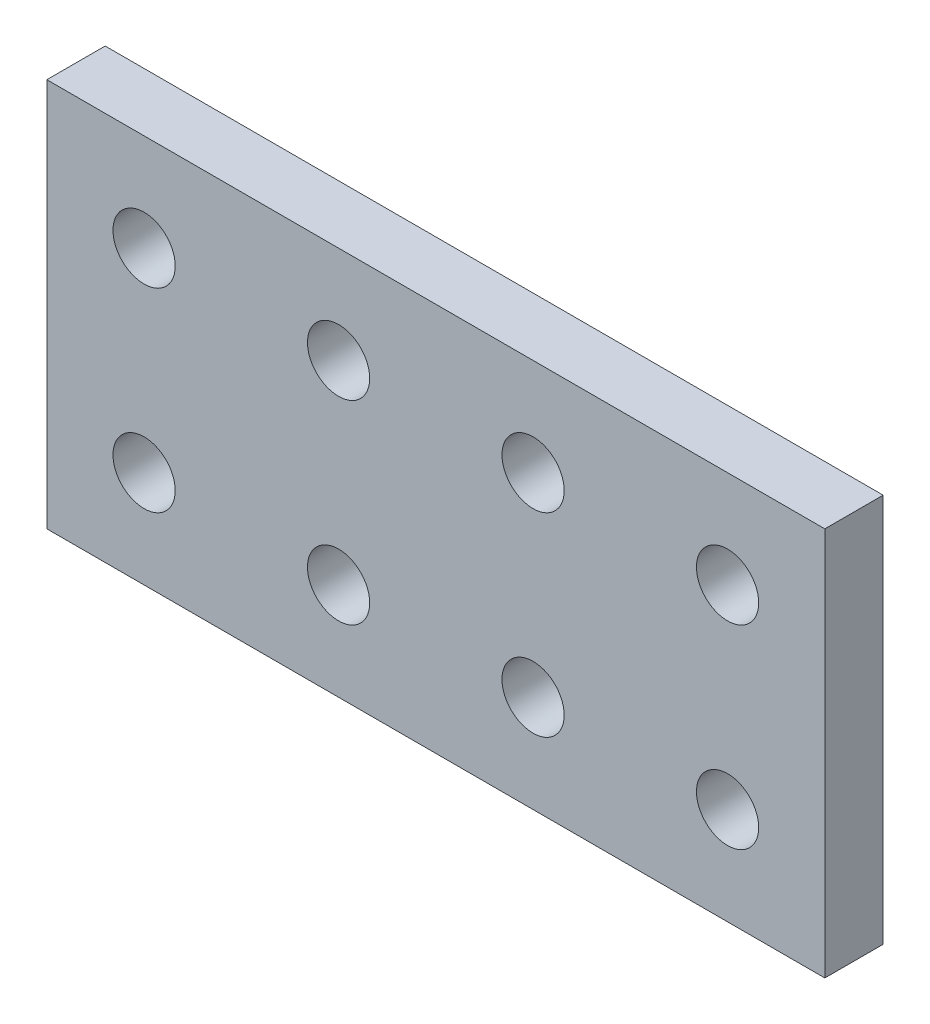
ISO-10303-21;
HEADER;
FILE_DESCRIPTION(('STEP AP214'),'2;1');
FILE_NAME('part.step','',(''),(''),'','','');
FILE_SCHEMA(('AUTOMOTIVE_DESIGN { 1 0 10303 214 1 1 1 1 }'));
ENDSEC;
DATA;
#1=APPLICATION_CONTEXT('core data for automotive mechanical design processes');
#2=APPLICATION_PROTOCOL_DEFINITION('international standard','automotive_design',2000,#1);
#3=PRODUCT_CONTEXT('',#1,'mechanical');
#4=PRODUCT('Part','Part','',(#3));
#5=PRODUCT_RELATED_PRODUCT_CATEGORY('part','',(#4));
#6=PRODUCT_DEFINITION_FORMATION('','',#4);
#7=PRODUCT_DEFINITION_CONTEXT('part definition',#1,'design');
#8=PRODUCT_DEFINITION('design','',#6,#7);
#9=PRODUCT_DEFINITION_SHAPE('','',#8);
#10=(LENGTH_UNIT() NAMED_UNIT(*) SI_UNIT(.MILLI.,.METRE.));
#11=(NAMED_UNIT(*) PLANE_ANGLE_UNIT() SI_UNIT($,.RADIAN.));
#12=(NAMED_UNIT(*) SI_UNIT($,.STERADIAN.) SOLID_ANGLE_UNIT());
#13=UNCERTAINTY_MEASURE_WITH_UNIT(LENGTH_MEASURE(1.E-05),#10,'distance_accuracy_value','');
#14=(GEOMETRIC_REPRESENTATION_CONTEXT(3) GLOBAL_UNCERTAINTY_ASSIGNED_CONTEXT((#13)) GLOBAL_UNIT_ASSIGNED_CONTEXT((#10,
#11,#12)) REPRESENTATION_CONTEXT('',''));
#15=CARTESIAN_POINT('',(0.,0.,0.));
#16=DIRECTION('',(0.,0.,1.));
#17=DIRECTION('',(1.,0.,0.));
#18=AXIS2_PLACEMENT_3D('',#15,#16,#17);
#19=CARTESIAN_POINT('',(63.1487874628401,0.,3.));
#20=DIRECTION('',(1.,0.,0.));
#21=DIRECTION('',(0.,1.,0.));
#22=AXIS2_PLACEMENT_3D('',#19,#20,#21);
#23=PLANE('',#22);
#24=DIRECTION('',(0.,-1.,0.));
#25=VECTOR('',#24,1.);
#26=CARTESIAN_POINT('',(63.1487874628401,0.,0.));
#27=LINE('',#26,#25);
#28=CARTESIAN_POINT('',(63.1487874628401,27.9269854949671,0.));
#29=VERTEX_POINT('',#28);
#30=CARTESIAN_POINT('',(63.1487874628401,7.92698549496712,0.));
#31=VERTEX_POINT('',#30);
#32=EDGE_CURVE('E152',#29,#31,#27,.T.);
#33=ORIENTED_EDGE('',*,*,#32,.F.);
#34=DIRECTION('',(0.,0.,-1.));
#35=VECTOR('',#34,1.);
#36=CARTESIAN_POINT('',(63.1487874628401,27.9269854949671,3.));
#37=LINE('',#36,#35);
#38=CARTESIAN_POINT('',(63.1487874628401,27.9269854949671,3.));
#39=VERTEX_POINT('',#38);
#40=EDGE_CURVE('E11',#39,#29,#37,.T.);
#41=ORIENTED_EDGE('',*,*,#40,.F.);
#42=DIRECTION('',(0.,-1.,0.));
#43=VECTOR('',#42,1.);
#44=CARTESIAN_POINT('',(63.1487874628401,0.,3.));
#45=LINE('',#44,#43);
#46=CARTESIAN_POINT('',(63.1487874628401,7.92698549496712,3.));
#47=VERTEX_POINT('',#46);
#48=EDGE_CURVE('E110',#39,#47,#45,.T.);
#49=ORIENTED_EDGE('',*,*,#48,.T.);
#50=DIRECTION('',(0.,0.,-1.));
#51=VECTOR('',#50,1.);
#52=CARTESIAN_POINT('',(63.1487874628401,7.92698549496712,3.));
#53=LINE('',#52,#51);
#54=EDGE_CURVE('E86',#47,#31,#53,.T.);
#55=ORIENTED_EDGE('',*,*,#54,.T.);
#56=EDGE_LOOP('',(#33,#41,#49,#55));
#57=FACE_BOUND('',#56,.T.);
#58=ADVANCED_FACE('F45',(#57),#23,.T.);
#59=CARTESIAN_POINT('',(0.,27.9269854949671,3.));
#60=DIRECTION('',(0.,1.,0.));
#61=DIRECTION('',(0.,0.,1.));
#62=AXIS2_PLACEMENT_3D('',#59,#60,#61);
#63=PLANE('',#62);
#64=DIRECTION('',(1.,0.,0.));
#65=VECTOR('',#64,1.);
#66=CARTESIAN_POINT('',(0.,27.9269854949671,0.));
#67=LINE('',#66,#65);
#68=CARTESIAN_POINT('',(23.14878746284,27.9269854949671,0.));
#69=VERTEX_POINT('',#68);
#70=EDGE_CURVE('E98',#69,#29,#67,.T.);
#71=ORIENTED_EDGE('',*,*,#70,.F.);
#72=DIRECTION('',(0.,0.,-1.));
#73=VECTOR('',#72,1.);
#74=CARTESIAN_POINT('',(23.14878746284,27.9269854949671,3.));
#75=LINE('',#74,#73);
#76=CARTESIAN_POINT('',(23.14878746284,27.9269854949671,3.));
#77=VERTEX_POINT('',#76);
#78=EDGE_CURVE('E55',#77,#69,#75,.T.);
#79=ORIENTED_EDGE('',*,*,#78,.F.);
#80=DIRECTION('',(1.,0.,0.));
#81=VECTOR('',#80,1.);
#82=CARTESIAN_POINT('',(0.,27.9269854949671,3.));
#83=LINE('',#82,#81);
#84=EDGE_CURVE('E96',#77,#39,#83,.T.);
#85=ORIENTED_EDGE('',*,*,#84,.T.);
#86=ORIENTED_EDGE('',*,*,#40,.T.);
#87=EDGE_LOOP('',(#71,#79,#85,#86));
#88=FACE_BOUND('',#87,.T.);
#89=ADVANCED_FACE('F94',(#88),#63,.T.);
#90=CARTESIAN_POINT('',(23.1487874628401,0.,3.));
#91=DIRECTION('',(1.,0.,0.));
#92=DIRECTION('',(0.,1.,0.));
#93=AXIS2_PLACEMENT_3D('',#90,#91,#92);
#94=PLANE('',#93);
#95=DIRECTION('',(0.,-1.,0.));
#96=VECTOR('',#95,1.);
#97=CARTESIAN_POINT('',(23.1487874628401,0.,0.));
#98=LINE('',#97,#96);
#99=CARTESIAN_POINT('',(23.1487874628401,7.92698549496712,0.));
#100=VERTEX_POINT('',#99);
#101=EDGE_CURVE('E157',#69,#100,#98,.T.);
#102=ORIENTED_EDGE('',*,*,#101,.T.);
#103=DIRECTION('',(0.,0.,-1.));
#104=VECTOR('',#103,1.);
#105=CARTESIAN_POINT('',(23.1487874628401,7.92698549496712,3.));
#106=LINE('',#105,#104);
#107=CARTESIAN_POINT('',(23.1487874628401,7.92698549496712,3.));
#108=VERTEX_POINT('',#107);
#109=EDGE_CURVE('E102',#108,#100,#106,.T.);
#110=ORIENTED_EDGE('',*,*,#109,.F.);
#111=DIRECTION('',(0.,-1.,0.));
#112=VECTOR('',#111,1.);
#113=CARTESIAN_POINT('',(23.1487874628401,0.,3.));
#114=LINE('',#113,#112);
#115=EDGE_CURVE('E104',#77,#108,#114,.T.);
#116=ORIENTED_EDGE('',*,*,#115,.F.);
#117=ORIENTED_EDGE('',*,*,#78,.T.);
#118=EDGE_LOOP('',(#102,#110,#116,#117));
#119=FACE_BOUND('',#118,.T.);
#120=ADVANCED_FACE('F105',(#119),#94,.F.);
#121=CARTESIAN_POINT('',(38.1487874628401,12.9269854949671,3.));
#122=DIRECTION('',(0.,0.,-1.));
#123=DIRECTION('',(-1.,0.,0.));
#124=AXIS2_PLACEMENT_3D('',#121,#122,#123);
#125=CYLINDRICAL_SURFACE('',#124,1.6);
#126=CARTESIAN_POINT('',(38.1487874628401,12.9269854949671,3.));
#127=DIRECTION('',(0.,0.,1.));
#128=DIRECTION('',(1.,0.,0.));
#129=AXIS2_PLACEMENT_3D('',#126,#127,#128);
#130=CIRCLE('',#129,1.6);
#131=CARTESIAN_POINT('',(39.74878746284,12.9269854949671,3.));
#132=VERTEX_POINT('',#131);
#133=EDGE_CURVE('E120',#132,#132,#130,.F.);
#134=ORIENTED_EDGE('',*,*,#133,.F.);
#135=EDGE_LOOP('',(#134));
#136=FACE_BOUND('',#135,.T.);
#137=CARTESIAN_POINT('',(38.1487874628401,12.9269854949671,0.));
#138=DIRECTION('',(0.,0.,1.));
#139=DIRECTION('',(1.,0.,0.));
#140=AXIS2_PLACEMENT_3D('',#137,#138,#139);
#141=CIRCLE('',#140,1.6);
#142=CARTESIAN_POINT('',(39.74878746284,12.9269854949671,0.));
#143=VERTEX_POINT('',#142);
#144=EDGE_CURVE('E162',#143,#143,#141,.F.);
#145=ORIENTED_EDGE('',*,*,#144,.T.);
#146=EDGE_LOOP('',(#145));
#147=FACE_BOUND('',#146,.T.);
#148=ADVANCED_FACE('F240',(#136,#147),#125,.F.);
#149=CARTESIAN_POINT('',(0.,7.92698549496712,3.));
#150=DIRECTION('',(0.,1.,0.));
#151=DIRECTION('',(-1.,0.,0.));
#152=AXIS2_PLACEMENT_3D('',#149,#150,#151);
#153=PLANE('',#152);
#154=DIRECTION('',(1.,0.,0.));
#155=VECTOR('',#154,1.);
#156=CARTESIAN_POINT('',(0.,7.92698549496712,0.));
#157=LINE('',#156,#155);
#158=EDGE_CURVE('E79',#100,#31,#157,.T.);
#159=ORIENTED_EDGE('',*,*,#158,.T.);
#160=ORIENTED_EDGE('',*,*,#54,.F.);
#161=DIRECTION('',(1.,0.,0.));
#162=VECTOR('',#161,1.);
#163=CARTESIAN_POINT('',(0.,7.92698549496712,3.));
#164=LINE('',#163,#162);
#165=EDGE_CURVE('E63',#108,#47,#164,.T.);
#166=ORIENTED_EDGE('',*,*,#165,.F.);
#167=ORIENTED_EDGE('',*,*,#109,.T.);
#168=EDGE_LOOP('',(#159,#160,#166,#167));
#169=FACE_BOUND('',#168,.T.);
#170=ADVANCED_FACE('F175',(#169),#153,.F.);
#171=CARTESIAN_POINT('',(48.14878746284,22.9269854949671,3.));
#172=DIRECTION('',(0.,0.,-1.));
#173=DIRECTION('',(-1.,0.,0.));
#174=AXIS2_PLACEMENT_3D('',#171,#172,#173);
#175=CYLINDRICAL_SURFACE('',#174,1.6);
#176=CARTESIAN_POINT('',(48.14878746284,22.9269854949671,3.));
#177=DIRECTION('',(0.,0.,1.));
#178=DIRECTION('',(1.,0.,0.));
#179=AXIS2_PLACEMENT_3D('',#176,#177,#178);
#180=CIRCLE('',#179,1.6);
#181=CARTESIAN_POINT('',(49.74878746284,22.9269854949671,3.));
#182=VERTEX_POINT('',#181);
#183=EDGE_CURVE('E114',#182,#182,#180,.T.);
#184=ORIENTED_EDGE('',*,*,#183,.T.);
#185=EDGE_LOOP('',(#184));
#186=FACE_BOUND('',#185,.T.);
#187=CARTESIAN_POINT('',(48.14878746284,22.9269854949671,0.));
#188=DIRECTION('',(0.,0.,1.));
#189=DIRECTION('',(1.,0.,0.));
#190=AXIS2_PLACEMENT_3D('',#187,#188,#189);
#191=CIRCLE('',#190,1.6);
#192=CARTESIAN_POINT('',(49.74878746284,22.9269854949671,0.));
#193=VERTEX_POINT('',#192);
#194=EDGE_CURVE('E148',#193,#193,#191,.T.);
#195=ORIENTED_EDGE('',*,*,#194,.F.);
#196=EDGE_LOOP('',(#195));
#197=FACE_BOUND('',#196,.T.);
#198=ADVANCED_FACE('F186',(#186,#197),#175,.F.);
#199=CARTESIAN_POINT('',(58.1487874628401,22.9269854949671,3.));
#200=DIRECTION('',(0.,0.,-1.));
#201=DIRECTION('',(-1.,0.,0.));
#202=AXIS2_PLACEMENT_3D('',#199,#200,#201);
#203=CYLINDRICAL_SURFACE('',#202,1.6);
#204=CARTESIAN_POINT('',(58.1487874628401,22.9269854949671,3.));
#205=DIRECTION('',(0.,0.,1.));
#206=DIRECTION('',(1.,0.,0.));
#207=AXIS2_PLACEMENT_3D('',#204,#205,#206);
#208=CIRCLE('',#207,1.6);
#209=CARTESIAN_POINT('',(59.74878746284,22.9269854949671,3.));
#210=VERTEX_POINT('',#209);
#211=EDGE_CURVE('E376',#210,#210,#208,.T.);
#212=ORIENTED_EDGE('',*,*,#211,.T.);
#213=EDGE_LOOP('',(#212));
#214=FACE_BOUND('',#213,.T.);
#215=CARTESIAN_POINT('',(58.1487874628401,22.9269854949671,0.));
#216=DIRECTION('',(0.,0.,1.));
#217=DIRECTION('',(1.,0.,0.));
#218=AXIS2_PLACEMENT_3D('',#215,#216,#217);
#219=CIRCLE('',#218,1.6);
#220=CARTESIAN_POINT('',(59.74878746284,22.9269854949671,0.));
#221=VERTEX_POINT('',#220);
#222=EDGE_CURVE('E144',#221,#221,#219,.T.);
#223=ORIENTED_EDGE('',*,*,#222,.F.);
#224=EDGE_LOOP('',(#223));
#225=FACE_BOUND('',#224,.T.);
#226=ADVANCED_FACE('F189',(#214,#225),#203,.F.);
#227=CARTESIAN_POINT('',(38.1487874628401,22.9269854949671,3.));
#228=DIRECTION('',(0.,0.,-1.));
#229=DIRECTION('',(-1.,0.,0.));
#230=AXIS2_PLACEMENT_3D('',#227,#228,#229);
#231=CYLINDRICAL_SURFACE('',#230,1.6);
#232=CARTESIAN_POINT('',(38.1487874628401,22.9269854949671,3.));
#233=DIRECTION('',(0.,0.,1.));
#234=DIRECTION('',(1.,0.,0.));
#235=AXIS2_PLACEMENT_3D('',#232,#233,#234);
#236=CIRCLE('',#235,1.6);
#237=CARTESIAN_POINT('',(39.74878746284,22.9269854949671,3.));
#238=VERTEX_POINT('',#237);
#239=EDGE_CURVE('E372',#238,#238,#236,.T.);
#240=ORIENTED_EDGE('',*,*,#239,.T.);
#241=EDGE_LOOP('',(#240));
#242=FACE_BOUND('',#241,.T.);
#243=CARTESIAN_POINT('',(38.1487874628401,22.9269854949671,0.));
#244=DIRECTION('',(0.,0.,1.));
#245=DIRECTION('',(1.,0.,0.));
#246=AXIS2_PLACEMENT_3D('',#243,#244,#245);
#247=CIRCLE('',#246,1.6);
#248=CARTESIAN_POINT('',(39.74878746284,22.9269854949671,0.));
#249=VERTEX_POINT('',#248);
#250=EDGE_CURVE('E140',#249,#249,#247,.T.);
#251=ORIENTED_EDGE('',*,*,#250,.F.);
#252=EDGE_LOOP('',(#251));
#253=FACE_BOUND('',#252,.T.);
#254=ADVANCED_FACE('F193',(#242,#253),#231,.F.);
#255=CARTESIAN_POINT('',(28.1487874628401,22.9269854949671,3.));
#256=DIRECTION('',(0.,0.,-1.));
#257=DIRECTION('',(-1.,0.,0.));
#258=AXIS2_PLACEMENT_3D('',#255,#256,#257);
#259=CYLINDRICAL_SURFACE('',#258,1.6);
#260=CARTESIAN_POINT('',(28.1487874628401,22.9269854949671,3.));
#261=DIRECTION('',(0.,0.,1.));
#262=DIRECTION('',(1.,0.,0.));
#263=AXIS2_PLACEMENT_3D('',#260,#261,#262);
#264=CIRCLE('',#263,1.6);
#265=CARTESIAN_POINT('',(29.7487874628401,22.9269854949671,3.));
#266=VERTEX_POINT('',#265);
#267=EDGE_CURVE('E368',#266,#266,#264,.T.);
#268=ORIENTED_EDGE('',*,*,#267,.T.);
#269=EDGE_LOOP('',(#268));
#270=FACE_BOUND('',#269,.T.);
#271=CARTESIAN_POINT('',(28.1487874628401,22.9269854949671,0.));
#272=DIRECTION('',(0.,0.,1.));
#273=DIRECTION('',(1.,0.,0.));
#274=AXIS2_PLACEMENT_3D('',#271,#272,#273);
#275=CIRCLE('',#274,1.6);
#276=CARTESIAN_POINT('',(29.7487874628401,22.9269854949671,0.));
#277=VERTEX_POINT('',#276);
#278=EDGE_CURVE('E136',#277,#277,#275,.T.);
#279=ORIENTED_EDGE('',*,*,#278,.F.);
#280=EDGE_LOOP('',(#279));
#281=FACE_BOUND('',#280,.T.);
#282=ADVANCED_FACE('F197',(#270,#281),#259,.F.);
#283=CARTESIAN_POINT('',(28.1487874628401,12.9269854949671,3.));
#284=DIRECTION('',(0.,0.,-1.));
#285=DIRECTION('',(-1.,0.,0.));
#286=AXIS2_PLACEMENT_3D('',#283,#284,#285);
#287=CYLINDRICAL_SURFACE('',#286,1.6);
#288=CARTESIAN_POINT('',(28.1487874628401,12.9269854949671,3.));
#289=DIRECTION('',(0.,0.,1.));
#290=DIRECTION('',(1.,0.,0.));
#291=AXIS2_PLACEMENT_3D('',#288,#289,#290);
#292=CIRCLE('',#291,1.6);
#293=CARTESIAN_POINT('',(29.7487874628401,12.9269854949671,3.));
#294=VERTEX_POINT('',#293);
#295=EDGE_CURVE('E212',#294,#294,#292,.F.);
#296=ORIENTED_EDGE('',*,*,#295,.F.);
#297=EDGE_LOOP('',(#296));
#298=FACE_BOUND('',#297,.T.);
#299=CARTESIAN_POINT('',(28.1487874628401,12.9269854949671,0.));
#300=DIRECTION('',(0.,0.,1.));
#301=DIRECTION('',(1.,0.,0.));
#302=AXIS2_PLACEMENT_3D('',#299,#300,#301);
#303=CIRCLE('',#302,1.6);
#304=CARTESIAN_POINT('',(29.7487874628401,12.9269854949671,0.));
#305=VERTEX_POINT('',#304);
#306=EDGE_CURVE('E132',#305,#305,#303,.F.);
#307=ORIENTED_EDGE('',*,*,#306,.T.);
#308=EDGE_LOOP('',(#307));
#309=FACE_BOUND('',#308,.T.);
#310=ADVANCED_FACE('F200',(#298,#309),#287,.F.);
#311=CARTESIAN_POINT('',(48.14878746284,12.9269854949671,3.));
#312=DIRECTION('',(0.,0.,-1.));
#313=DIRECTION('',(-1.,0.,0.));
#314=AXIS2_PLACEMENT_3D('',#311,#312,#313);
#315=CYLINDRICAL_SURFACE('',#314,1.6);
#316=CARTESIAN_POINT('',(48.14878746284,12.9269854949671,3.));
#317=DIRECTION('',(0.,0.,1.));
#318=DIRECTION('',(1.,0.,0.));
#319=AXIS2_PLACEMENT_3D('',#316,#317,#318);
#320=CIRCLE('',#319,1.6);
#321=CARTESIAN_POINT('',(49.74878746284,12.9269854949671,3.));
#322=VERTEX_POINT('',#321);
#323=EDGE_CURVE('E170',#322,#322,#320,.F.);
#324=ORIENTED_EDGE('',*,*,#323,.F.);
#325=EDGE_LOOP('',(#324));
#326=FACE_BOUND('',#325,.T.);
#327=CARTESIAN_POINT('',(48.14878746284,12.9269854949671,0.));
#328=DIRECTION('',(0.,0.,1.));
#329=DIRECTION('',(1.,0.,0.));
#330=AXIS2_PLACEMENT_3D('',#327,#328,#329);
#331=CIRCLE('',#330,1.6);
#332=CARTESIAN_POINT('',(49.74878746284,12.9269854949671,0.));
#333=VERTEX_POINT('',#332);
#334=EDGE_CURVE('E128',#333,#333,#331,.F.);
#335=ORIENTED_EDGE('',*,*,#334,.T.);
#336=EDGE_LOOP('',(#335));
#337=FACE_BOUND('',#336,.T.);
#338=ADVANCED_FACE('F47',(#326,#337),#315,.F.);
#339=CARTESIAN_POINT('',(58.1487874628401,12.9269854949671,3.));
#340=DIRECTION('',(0.,0.,-1.));
#341=DIRECTION('',(-1.,0.,0.));
#342=AXIS2_PLACEMENT_3D('',#339,#340,#341);
#343=CYLINDRICAL_SURFACE('',#342,1.6);
#344=CARTESIAN_POINT('',(58.1487874628401,12.9269854949671,3.));
#345=DIRECTION('',(0.,0.,1.));
#346=DIRECTION('',(1.,0.,0.));
#347=AXIS2_PLACEMENT_3D('',#344,#345,#346);
#348=CIRCLE('',#347,1.6);
#349=CARTESIAN_POINT('',(59.7487874628401,12.9269854949671,3.));
#350=VERTEX_POINT('',#349);
#351=EDGE_CURVE('E124',#350,#350,#348,.F.);
#352=ORIENTED_EDGE('',*,*,#351,.F.);
#353=EDGE_LOOP('',(#352));
#354=FACE_BOUND('',#353,.T.);
#355=CARTESIAN_POINT('',(58.1487874628401,12.9269854949671,0.));
#356=DIRECTION('',(0.,0.,1.));
#357=DIRECTION('',(1.,0.,0.));
#358=AXIS2_PLACEMENT_3D('',#355,#356,#357);
#359=CIRCLE('',#358,1.6);
#360=CARTESIAN_POINT('',(59.7487874628401,12.9269854949671,0.));
#361=VERTEX_POINT('',#360);
#362=EDGE_CURVE('E166',#361,#361,#359,.F.);
#363=ORIENTED_EDGE('',*,*,#362,.T.);
#364=EDGE_LOOP('',(#363));
#365=FACE_BOUND('',#364,.T.);
#366=ADVANCED_FACE('F207',(#354,#365),#343,.F.);
#367=CARTESIAN_POINT('',(0.,0.,3.));
#368=DIRECTION('',(0.,0.,1.));
#369=DIRECTION('',(1.,0.,0.));
#370=AXIS2_PLACEMENT_3D('',#367,#368,#369);
#371=PLANE('',#370);
#372=ORIENTED_EDGE('',*,*,#323,.T.);
#373=EDGE_LOOP('',(#372));
#374=FACE_BOUND('',#373,.T.);
#375=ORIENTED_EDGE('',*,*,#295,.T.);
#376=EDGE_LOOP('',(#375));
#377=FACE_BOUND('',#376,.T.);
#378=ORIENTED_EDGE('',*,*,#267,.F.);
#379=EDGE_LOOP('',(#378));
#380=FACE_BOUND('',#379,.T.);
#381=ORIENTED_EDGE('',*,*,#239,.F.);
#382=EDGE_LOOP('',(#381));
#383=FACE_BOUND('',#382,.T.);
#384=ORIENTED_EDGE('',*,*,#211,.F.);
#385=EDGE_LOOP('',(#384));
#386=FACE_BOUND('',#385,.T.);
#387=ORIENTED_EDGE('',*,*,#183,.F.);
#388=EDGE_LOOP('',(#387));
#389=FACE_BOUND('',#388,.T.);
#390=ORIENTED_EDGE('',*,*,#48,.F.);
#391=ORIENTED_EDGE('',*,*,#84,.F.);
#392=ORIENTED_EDGE('',*,*,#115,.T.);
#393=ORIENTED_EDGE('',*,*,#165,.T.);
#394=EDGE_LOOP('',(#390,#391,#392,#393));
#395=FACE_BOUND('',#394,.T.);
#396=ORIENTED_EDGE('',*,*,#133,.T.);
#397=EDGE_LOOP('',(#396));
#398=FACE_BOUND('',#397,.T.);
#399=ORIENTED_EDGE('',*,*,#351,.T.);
#400=EDGE_LOOP('',(#399));
#401=FACE_BOUND('',#400,.T.);
#402=ADVANCED_FACE('F108',(#374,#377,#380,#383,#386,#389,#395,#398,#401),#371,.T.);
#403=CARTESIAN_POINT('',(0.,0.,0.));
#404=DIRECTION('',(0.,0.,1.));
#405=DIRECTION('',(1.,0.,0.));
#406=AXIS2_PLACEMENT_3D('',#403,#404,#405);
#407=PLANE('',#406);
#408=ORIENTED_EDGE('',*,*,#334,.F.);
#409=EDGE_LOOP('',(#408));
#410=FACE_BOUND('',#409,.T.);
#411=ORIENTED_EDGE('',*,*,#306,.F.);
#412=EDGE_LOOP('',(#411));
#413=FACE_BOUND('',#412,.T.);
#414=ORIENTED_EDGE('',*,*,#278,.T.);
#415=EDGE_LOOP('',(#414));
#416=FACE_BOUND('',#415,.T.);
#417=ORIENTED_EDGE('',*,*,#250,.T.);
#418=EDGE_LOOP('',(#417));
#419=FACE_BOUND('',#418,.T.);
#420=ORIENTED_EDGE('',*,*,#222,.T.);
#421=EDGE_LOOP('',(#420));
#422=FACE_BOUND('',#421,.T.);
#423=ORIENTED_EDGE('',*,*,#194,.T.);
#424=EDGE_LOOP('',(#423));
#425=FACE_BOUND('',#424,.T.);
#426=ORIENTED_EDGE('',*,*,#32,.T.);
#427=ORIENTED_EDGE('',*,*,#158,.F.);
#428=ORIENTED_EDGE('',*,*,#101,.F.);
#429=ORIENTED_EDGE('',*,*,#70,.T.);
#430=EDGE_LOOP('',(#426,#427,#428,#429));
#431=FACE_BOUND('',#430,.T.);
#432=ORIENTED_EDGE('',*,*,#144,.F.);
#433=EDGE_LOOP('',(#432));
#434=FACE_BOUND('',#433,.T.);
#435=ORIENTED_EDGE('',*,*,#362,.F.);
#436=EDGE_LOOP('',(#435));
#437=FACE_BOUND('',#436,.T.);
#438=ADVANCED_FACE('F176',(#410,#413,#416,#419,#422,#425,#431,#434,#437),#407,.F.);
#439=CLOSED_SHELL('',(#58,#89,#120,#148,#170,#198,#226,#254,#282,#310,#338,#366,#402,#438));
#440=MANIFOLD_SOLID_BREP('B2',#439);
#441=ADVANCED_BREP_SHAPE_REPRESENTATION('',(#18,#440),#14);
#442=SHAPE_DEFINITION_REPRESENTATION(#9,#441);
ENDSEC;
END-ISO-10303-21;
